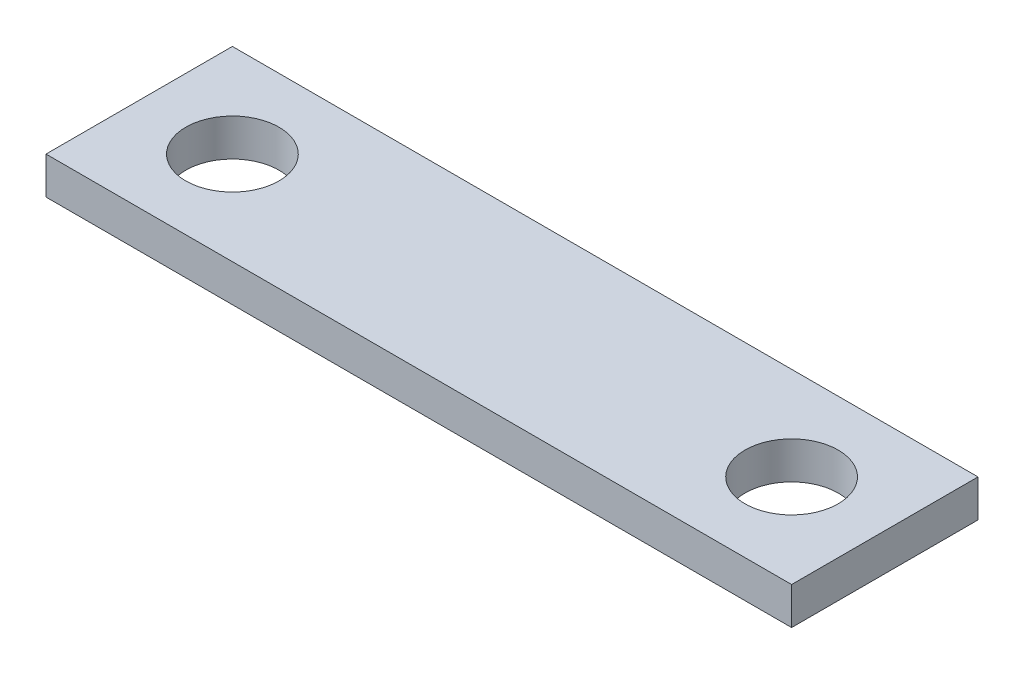
ISO-10303-21;
HEADER;
FILE_DESCRIPTION(('STEP AP214'),'2;1');
FILE_NAME('part.step','',(''),(''),'','','');
FILE_SCHEMA(('AUTOMOTIVE_DESIGN { 1 0 10303 214 1 1 1 1 }'));
ENDSEC;
DATA;
#1=APPLICATION_CONTEXT('core data for automotive mechanical design processes');
#2=APPLICATION_PROTOCOL_DEFINITION('international standard','automotive_design',2000,#1);
#3=PRODUCT_CONTEXT('',#1,'mechanical');
#4=PRODUCT('Part','Part','',(#3));
#5=PRODUCT_RELATED_PRODUCT_CATEGORY('part','',(#4));
#6=PRODUCT_DEFINITION_FORMATION('','',#4);
#7=PRODUCT_DEFINITION_CONTEXT('part definition',#1,'design');
#8=PRODUCT_DEFINITION('design','',#6,#7);
#9=PRODUCT_DEFINITION_SHAPE('','',#8);
#10=(LENGTH_UNIT() NAMED_UNIT(*) SI_UNIT(.MILLI.,.METRE.));
#11=(NAMED_UNIT(*) PLANE_ANGLE_UNIT() SI_UNIT($,.RADIAN.));
#12=(NAMED_UNIT(*) SI_UNIT($,.STERADIAN.) SOLID_ANGLE_UNIT());
#13=UNCERTAINTY_MEASURE_WITH_UNIT(LENGTH_MEASURE(1.E-05),#10,'distance_accuracy_value','');
#14=(GEOMETRIC_REPRESENTATION_CONTEXT(3) GLOBAL_UNCERTAINTY_ASSIGNED_CONTEXT((#13)) GLOBAL_UNIT_ASSIGNED_CONTEXT((#10,
#11,#12)) REPRESENTATION_CONTEXT('',''));
#15=CARTESIAN_POINT('',(0.,0.,0.));
#16=DIRECTION('',(0.,0.,1.));
#17=DIRECTION('',(1.,0.,0.));
#18=AXIS2_PLACEMENT_3D('',#15,#16,#17);
#19=CARTESIAN_POINT('',(0.,1.,0.));
#20=DIRECTION('',(0.,1.,0.));
#21=DIRECTION('',(0.,0.,1.));
#22=AXIS2_PLACEMENT_3D('',#19,#20,#21);
#23=PLANE('',#22);
#24=CARTESIAN_POINT('',(-7.5,1.,0.));
#25=DIRECTION('',(0.,1.,0.));
#26=DIRECTION('',(0.,0.,1.));
#27=AXIS2_PLACEMENT_3D('',#24,#25,#26);
#28=CIRCLE('',#27,1.25);
#29=CARTESIAN_POINT('',(-7.5,1.,1.25));
#30=VERTEX_POINT('',#29);
#31=EDGE_CURVE('E101',#30,#30,#28,.T.);
#32=ORIENTED_EDGE('',*,*,#31,.F.);
#33=EDGE_LOOP('',(#32));
#34=FACE_BOUND('',#33,.T.);
#35=DIRECTION('',(0.,0.,-1.));
#36=VECTOR('',#35,1.);
#37=CARTESIAN_POINT('',(10.,1.,-2.5));
#38=LINE('',#37,#36);
#39=CARTESIAN_POINT('',(10.,1.,2.5));
#40=VERTEX_POINT('',#39);
#41=CARTESIAN_POINT('',(10.,1.,-2.5));
#42=VERTEX_POINT('',#41);
#43=EDGE_CURVE('E86',#40,#42,#38,.T.);
#44=ORIENTED_EDGE('',*,*,#43,.T.);
#45=DIRECTION('',(-1.,0.,0.));
#46=VECTOR('',#45,1.);
#47=CARTESIAN_POINT('',(-10.,1.,-2.5));
#48=LINE('',#47,#46);
#49=CARTESIAN_POINT('',(-10.,1.,-2.5));
#50=VERTEX_POINT('',#49);
#51=EDGE_CURVE('E81',#42,#50,#48,.T.);
#52=ORIENTED_EDGE('',*,*,#51,.T.);
#53=DIRECTION('',(0.,0.,1.));
#54=VECTOR('',#53,1.);
#55=CARTESIAN_POINT('',(-10.,1.,-2.5));
#56=LINE('',#55,#54);
#57=CARTESIAN_POINT('',(-10.,1.,2.5));
#58=VERTEX_POINT('',#57);
#59=EDGE_CURVE('E84',#50,#58,#56,.T.);
#60=ORIENTED_EDGE('',*,*,#59,.T.);
#61=DIRECTION('',(1.,0.,0.));
#62=VECTOR('',#61,1.);
#63=CARTESIAN_POINT('',(-10.,1.,2.5));
#64=LINE('',#63,#62);
#65=EDGE_CURVE('E51',#58,#40,#64,.T.);
#66=ORIENTED_EDGE('',*,*,#65,.T.);
#67=EDGE_LOOP('',(#44,#52,#60,#66));
#68=FACE_BOUND('',#67,.T.);
#69=CARTESIAN_POINT('',(7.5,1.,0.));
#70=DIRECTION('',(0.,1.,0.));
#71=DIRECTION('',(0.,0.,-1.));
#72=AXIS2_PLACEMENT_3D('',#69,#70,#71);
#73=CIRCLE('',#72,1.25);
#74=CARTESIAN_POINT('',(7.5,1.,-1.25));
#75=VERTEX_POINT('',#74);
#76=EDGE_CURVE('E116',#75,#75,#73,.T.);
#77=ORIENTED_EDGE('',*,*,#76,.F.);
#78=EDGE_LOOP('',(#77));
#79=FACE_BOUND('',#78,.T.);
#80=ADVANCED_FACE('F34',(#34,#68,#79),#23,.T.);
#81=CARTESIAN_POINT('',(0.,0.,0.));
#82=DIRECTION('',(0.,1.,0.));
#83=DIRECTION('',(0.,0.,1.));
#84=AXIS2_PLACEMENT_3D('',#81,#82,#83);
#85=PLANE('',#84);
#86=DIRECTION('',(0.,0.,-1.));
#87=VECTOR('',#86,1.);
#88=CARTESIAN_POINT('',(10.,0.,-2.5));
#89=LINE('',#88,#87);
#90=CARTESIAN_POINT('',(10.,0.,2.5));
#91=VERTEX_POINT('',#90);
#92=CARTESIAN_POINT('',(10.,0.,-2.5));
#93=VERTEX_POINT('',#92);
#94=EDGE_CURVE('E98',#91,#93,#89,.T.);
#95=ORIENTED_EDGE('',*,*,#94,.F.);
#96=DIRECTION('',(1.,0.,0.));
#97=VECTOR('',#96,1.);
#98=CARTESIAN_POINT('',(-10.,0.,2.5));
#99=LINE('',#98,#97);
#100=CARTESIAN_POINT('',(-10.,0.,2.5));
#101=VERTEX_POINT('',#100);
#102=EDGE_CURVE('E74',#101,#91,#99,.T.);
#103=ORIENTED_EDGE('',*,*,#102,.F.);
#104=DIRECTION('',(0.,0.,1.));
#105=VECTOR('',#104,1.);
#106=CARTESIAN_POINT('',(-10.,0.,-2.5));
#107=LINE('',#106,#105);
#108=CARTESIAN_POINT('',(-10.,0.,-2.5));
#109=VERTEX_POINT('',#108);
#110=EDGE_CURVE('E68',#109,#101,#107,.T.);
#111=ORIENTED_EDGE('',*,*,#110,.F.);
#112=DIRECTION('',(-1.,0.,0.));
#113=VECTOR('',#112,1.);
#114=CARTESIAN_POINT('',(-10.,0.,-2.5));
#115=LINE('',#114,#113);
#116=EDGE_CURVE('E90',#93,#109,#115,.T.);
#117=ORIENTED_EDGE('',*,*,#116,.F.);
#118=EDGE_LOOP('',(#95,#103,#111,#117));
#119=FACE_BOUND('',#118,.T.);
#120=CARTESIAN_POINT('',(-7.5,0.,0.));
#121=DIRECTION('',(0.,1.,0.));
#122=DIRECTION('',(0.,0.,1.));
#123=AXIS2_PLACEMENT_3D('',#120,#121,#122);
#124=CIRCLE('',#123,1.25);
#125=CARTESIAN_POINT('',(-7.5,0.,1.25));
#126=VERTEX_POINT('',#125);
#127=EDGE_CURVE('E113',#126,#126,#124,.T.);
#128=ORIENTED_EDGE('',*,*,#127,.T.);
#129=EDGE_LOOP('',(#128));
#130=FACE_BOUND('',#129,.T.);
#131=CARTESIAN_POINT('',(7.5,0.,0.));
#132=DIRECTION('',(0.,1.,0.));
#133=DIRECTION('',(0.,0.,-1.));
#134=AXIS2_PLACEMENT_3D('',#131,#132,#133);
#135=CIRCLE('',#134,1.25);
#136=CARTESIAN_POINT('',(7.5,0.,-1.25));
#137=VERTEX_POINT('',#136);
#138=EDGE_CURVE('E119',#137,#137,#135,.T.);
#139=ORIENTED_EDGE('',*,*,#138,.T.);
#140=EDGE_LOOP('',(#139));
#141=FACE_BOUND('',#140,.T.);
#142=ADVANCED_FACE('F109',(#119,#130,#141),#85,.F.);
#143=CARTESIAN_POINT('',(10.,1.,-2.5));
#144=DIRECTION('',(-1.,0.,0.));
#145=DIRECTION('',(0.,0.,1.));
#146=AXIS2_PLACEMENT_3D('',#143,#144,#145);
#147=PLANE('',#146);
#148=ORIENTED_EDGE('',*,*,#94,.T.);
#149=DIRECTION('',(0.,-1.,0.));
#150=VECTOR('',#149,1.);
#151=CARTESIAN_POINT('',(10.,1.,-2.5));
#152=LINE('',#151,#150);
#153=EDGE_CURVE('E11',#42,#93,#152,.T.);
#154=ORIENTED_EDGE('',*,*,#153,.F.);
#155=ORIENTED_EDGE('',*,*,#43,.F.);
#156=DIRECTION('',(0.,-1.,0.));
#157=VECTOR('',#156,1.);
#158=CARTESIAN_POINT('',(10.,1.,2.5));
#159=LINE('',#158,#157);
#160=EDGE_CURVE('E94',#40,#91,#159,.T.);
#161=ORIENTED_EDGE('',*,*,#160,.T.);
#162=EDGE_LOOP('',(#148,#154,#155,#161));
#163=FACE_BOUND('',#162,.T.);
#164=ADVANCED_FACE('F36',(#163),#147,.F.);
#165=CARTESIAN_POINT('',(-10.,1.,-2.5));
#166=DIRECTION('',(0.,0.,1.));
#167=DIRECTION('',(1.,0.,0.));
#168=AXIS2_PLACEMENT_3D('',#165,#166,#167);
#169=PLANE('',#168);
#170=ORIENTED_EDGE('',*,*,#116,.T.);
#171=DIRECTION('',(0.,-1.,0.));
#172=VECTOR('',#171,1.);
#173=CARTESIAN_POINT('',(-10.,1.,-2.5));
#174=LINE('',#173,#172);
#175=EDGE_CURVE('E43',#50,#109,#174,.T.);
#176=ORIENTED_EDGE('',*,*,#175,.F.);
#177=ORIENTED_EDGE('',*,*,#51,.F.);
#178=ORIENTED_EDGE('',*,*,#153,.T.);
#179=EDGE_LOOP('',(#170,#176,#177,#178));
#180=FACE_BOUND('',#179,.T.);
#181=ADVANCED_FACE('F89',(#180),#169,.F.);
#182=CARTESIAN_POINT('',(-10.,1.,-2.5));
#183=DIRECTION('',(1.,0.,0.));
#184=DIRECTION('',(0.,0.,-1.));
#185=AXIS2_PLACEMENT_3D('',#182,#183,#184);
#186=PLANE('',#185);
#187=ORIENTED_EDGE('',*,*,#110,.T.);
#188=DIRECTION('',(0.,-1.,0.));
#189=VECTOR('',#188,1.);
#190=CARTESIAN_POINT('',(-10.,1.,2.5));
#191=LINE('',#190,#189);
#192=EDGE_CURVE('E91',#58,#101,#191,.T.);
#193=ORIENTED_EDGE('',*,*,#192,.F.);
#194=ORIENTED_EDGE('',*,*,#59,.F.);
#195=ORIENTED_EDGE('',*,*,#175,.T.);
#196=EDGE_LOOP('',(#187,#193,#194,#195));
#197=FACE_BOUND('',#196,.T.);
#198=ADVANCED_FACE('F92',(#197),#186,.F.);
#199=CARTESIAN_POINT('',(-10.,1.,2.5));
#200=DIRECTION('',(0.,0.,-1.));
#201=DIRECTION('',(-1.,0.,0.));
#202=AXIS2_PLACEMENT_3D('',#199,#200,#201);
#203=PLANE('',#202);
#204=ORIENTED_EDGE('',*,*,#102,.T.);
#205=ORIENTED_EDGE('',*,*,#160,.F.);
#206=ORIENTED_EDGE('',*,*,#65,.F.);
#207=ORIENTED_EDGE('',*,*,#192,.T.);
#208=EDGE_LOOP('',(#204,#205,#206,#207));
#209=FACE_BOUND('',#208,.T.);
#210=ADVANCED_FACE('F106',(#209),#203,.F.);
#211=CARTESIAN_POINT('',(-7.5,1.,0.));
#212=DIRECTION('',(0.,-1.,0.));
#213=DIRECTION('',(0.,0.,-1.));
#214=AXIS2_PLACEMENT_3D('',#211,#212,#213);
#215=CYLINDRICAL_SURFACE('',#214,1.25);
#216=ORIENTED_EDGE('',*,*,#31,.T.);
#217=EDGE_LOOP('',(#216));
#218=FACE_BOUND('',#217,.T.);
#219=ORIENTED_EDGE('',*,*,#127,.F.);
#220=EDGE_LOOP('',(#219));
#221=FACE_BOUND('',#220,.T.);
#222=ADVANCED_FACE('F136',(#218,#221),#215,.F.);
#223=CARTESIAN_POINT('',(7.5,1.,0.));
#224=DIRECTION('',(0.,-1.,0.));
#225=DIRECTION('',(0.,0.,-1.));
#226=AXIS2_PLACEMENT_3D('',#223,#224,#225);
#227=CYLINDRICAL_SURFACE('',#226,1.25);
#228=ORIENTED_EDGE('',*,*,#76,.T.);
#229=EDGE_LOOP('',(#228));
#230=FACE_BOUND('',#229,.T.);
#231=ORIENTED_EDGE('',*,*,#138,.F.);
#232=EDGE_LOOP('',(#231));
#233=FACE_BOUND('',#232,.T.);
#234=ADVANCED_FACE('F125',(#230,#233),#227,.F.);
#235=CLOSED_SHELL('',(#80,#142,#164,#181,#198,#210,#222,#234));
#236=MANIFOLD_SOLID_BREP('B2',#235);
#237=ADVANCED_BREP_SHAPE_REPRESENTATION('',(#18,#236),#14);
#238=SHAPE_DEFINITION_REPRESENTATION(#9,#237);
ENDSEC;
END-ISO-10303-21;
